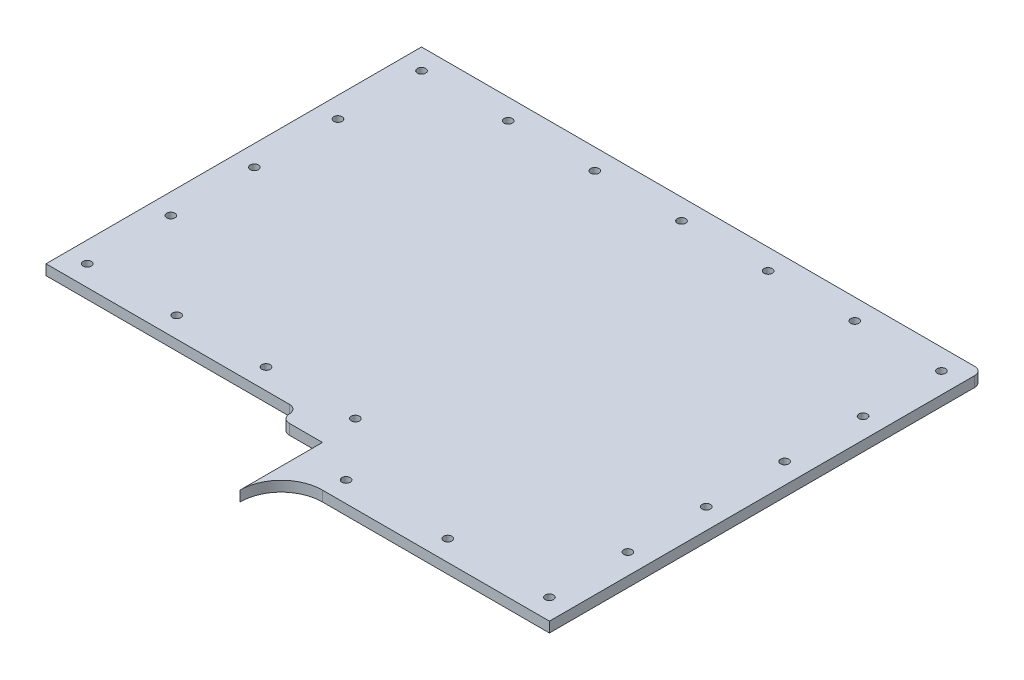
ISO-10303-21;
HEADER;
FILE_DESCRIPTION(('STEP AP214'),'2;1');
FILE_NAME('part.step','',(''),(''),'','','');
FILE_SCHEMA(('AUTOMOTIVE_DESIGN { 1 0 10303 214 1 1 1 1 }'));
ENDSEC;
DATA;
#1=APPLICATION_CONTEXT('core data for automotive mechanical design processes');
#2=APPLICATION_PROTOCOL_DEFINITION('international standard','automotive_design',2000,#1);
#3=PRODUCT_CONTEXT('',#1,'mechanical');
#4=PRODUCT('Part','Part','',(#3));
#5=PRODUCT_RELATED_PRODUCT_CATEGORY('part','',(#4));
#6=PRODUCT_DEFINITION_FORMATION('','',#4);
#7=PRODUCT_DEFINITION_CONTEXT('part definition',#1,'design');
#8=PRODUCT_DEFINITION('design','',#6,#7);
#9=PRODUCT_DEFINITION_SHAPE('','',#8);
#10=(LENGTH_UNIT() NAMED_UNIT(*) SI_UNIT(.MILLI.,.METRE.));
#11=(NAMED_UNIT(*) PLANE_ANGLE_UNIT() SI_UNIT($,.RADIAN.));
#12=(NAMED_UNIT(*) SI_UNIT($,.STERADIAN.) SOLID_ANGLE_UNIT());
#13=UNCERTAINTY_MEASURE_WITH_UNIT(LENGTH_MEASURE(1.E-05),#10,'distance_accuracy_value','');
#14=(GEOMETRIC_REPRESENTATION_CONTEXT(3) GLOBAL_UNCERTAINTY_ASSIGNED_CONTEXT((#13)) GLOBAL_UNIT_ASSIGNED_CONTEXT((#10,
#11,#12)) REPRESENTATION_CONTEXT('',''));
#15=CARTESIAN_POINT('',(0.,0.,0.));
#16=DIRECTION('',(0.,0.,1.));
#17=DIRECTION('',(1.,0.,0.));
#18=AXIS2_PLACEMENT_3D('',#15,#16,#17);
#19=CARTESIAN_POINT('',(8.88999999999993,1.5875,73.025));
#20=DIRECTION('',(0.,-1.,0.));
#21=DIRECTION('',(0.,0.,-1.));
#22=AXIS2_PLACEMENT_3D('',#19,#20,#21);
#23=CYLINDRICAL_SURFACE('',#22,6.34999999999999);
#24=CARTESIAN_POINT('',(8.88999999999993,0.,73.025));
#25=DIRECTION('',(0.,-1.,0.));
#26=DIRECTION('',(0.,0.,1.));
#27=AXIS2_PLACEMENT_3D('',#24,#25,#26);
#28=CIRCLE('',#27,6.34999999999999);
#29=CARTESIAN_POINT('',(2.53999999999993,0.,73.025));
#30=VERTEX_POINT('',#29);
#31=CARTESIAN_POINT('',(8.8899999999999,0.,66.675));
#32=VERTEX_POINT('',#31);
#33=EDGE_CURVE('E157',#30,#32,#28,.T.);
#34=ORIENTED_EDGE('',*,*,#33,.T.);
#35=DIRECTION('',(0.,-1.,0.));
#36=VECTOR('',#35,1.);
#37=CARTESIAN_POINT('',(8.8899999999999,1.5875,66.675));
#38=LINE('',#37,#36);
#39=CARTESIAN_POINT('',(8.8899999999999,1.5875,66.675));
#40=VERTEX_POINT('',#39);
#41=EDGE_CURVE('E11',#40,#32,#38,.T.);
#42=ORIENTED_EDGE('',*,*,#41,.F.);
#43=CARTESIAN_POINT('',(8.88999999999993,1.5875,73.025));
#44=DIRECTION('',(0.,-1.,0.));
#45=DIRECTION('',(0.,0.,1.));
#46=AXIS2_PLACEMENT_3D('',#43,#44,#45);
#47=CIRCLE('',#46,6.34999999999999);
#48=CARTESIAN_POINT('',(2.53999999999993,1.5875,73.025));
#49=VERTEX_POINT('',#48);
#50=EDGE_CURVE('E189',#49,#40,#47,.T.);
#51=ORIENTED_EDGE('',*,*,#50,.F.);
#52=DIRECTION('',(0.,-1.,0.));
#53=VECTOR('',#52,1.);
#54=CARTESIAN_POINT('',(2.53999999999993,1.5875,73.025));
#55=LINE('',#54,#53);
#56=EDGE_CURVE('E153',#49,#30,#55,.T.);
#57=ORIENTED_EDGE('',*,*,#56,.T.);
#58=EDGE_LOOP('',(#34,#42,#51,#57));
#59=FACE_BOUND('',#58,.T.);
#60=ADVANCED_FACE('F38',(#59),#23,.F.);
#61=CARTESIAN_POINT('',(8.8899999999999,1.5875,66.675));
#62=DIRECTION('',(0.,0.,-1.));
#63=DIRECTION('',(-1.,0.,0.));
#64=AXIS2_PLACEMENT_3D('',#61,#62,#63);
#65=PLANE('',#64);
#66=DIRECTION('',(1.,0.,0.));
#67=VECTOR('',#66,1.);
#68=CARTESIAN_POINT('',(8.8899999999999,0.,66.675));
#69=LINE('',#68,#67);
#70=CARTESIAN_POINT('',(43.815,0.,66.675));
#71=VERTEX_POINT('',#70);
#72=EDGE_CURVE('E161',#32,#71,#69,.T.);
#73=ORIENTED_EDGE('',*,*,#72,.T.);
#74=DIRECTION('',(0.,-1.,0.));
#75=VECTOR('',#74,1.);
#76=CARTESIAN_POINT('',(43.815,1.5875,66.675));
#77=LINE('',#76,#75);
#78=CARTESIAN_POINT('',(43.815,1.5875,66.675));
#79=VERTEX_POINT('',#78);
#80=EDGE_CURVE('E47',#79,#71,#77,.T.);
#81=ORIENTED_EDGE('',*,*,#80,.F.);
#82=DIRECTION('',(1.,0.,0.));
#83=VECTOR('',#82,1.);
#84=CARTESIAN_POINT('',(8.8899999999999,1.5875,66.675));
#85=LINE('',#84,#83);
#86=EDGE_CURVE('E107',#40,#79,#85,.T.);
#87=ORIENTED_EDGE('',*,*,#86,.F.);
#88=ORIENTED_EDGE('',*,*,#41,.T.);
#89=EDGE_LOOP('',(#73,#81,#87,#88));
#90=FACE_BOUND('',#89,.T.);
#91=ADVANCED_FACE('F277',(#90),#65,.F.);
#92=CARTESIAN_POINT('',(43.815,1.5875,66.675));
#93=DIRECTION('',(-1.,0.,0.));
#94=DIRECTION('',(0.,0.,1.));
#95=AXIS2_PLACEMENT_3D('',#92,#93,#94);
#96=PLANE('',#95);
#97=DIRECTION('',(0.,0.,-1.));
#98=VECTOR('',#97,1.);
#99=CARTESIAN_POINT('',(43.815,0.,66.675));
#100=LINE('',#99,#98);
#101=CARTESIAN_POINT('',(43.815,0.,1.26999999999999));
#102=VERTEX_POINT('',#101);
#103=EDGE_CURVE('E165',#71,#102,#100,.T.);
#104=ORIENTED_EDGE('',*,*,#103,.T.);
#105=DIRECTION('',(0.,-1.,0.));
#106=VECTOR('',#105,1.);
#107=CARTESIAN_POINT('',(43.815,1.5875,1.26999999999999));
#108=LINE('',#107,#106);
#109=CARTESIAN_POINT('',(43.815,1.5875,1.26999999999999));
#110=VERTEX_POINT('',#109);
#111=EDGE_CURVE('E212',#110,#102,#108,.T.);
#112=ORIENTED_EDGE('',*,*,#111,.F.);
#113=DIRECTION('',(0.,0.,-1.));
#114=VECTOR('',#113,1.);
#115=CARTESIAN_POINT('',(43.815,1.5875,66.675));
#116=LINE('',#115,#114);
#117=EDGE_CURVE('E222',#79,#110,#116,.T.);
#118=ORIENTED_EDGE('',*,*,#117,.F.);
#119=ORIENTED_EDGE('',*,*,#80,.T.);
#120=EDGE_LOOP('',(#104,#112,#118,#119));
#121=FACE_BOUND('',#120,.T.);
#122=ADVANCED_FACE('F220',(#121),#96,.F.);
#123=CARTESIAN_POINT('',(42.5796667647193,1.5875,1.23533323528069));
#124=DIRECTION('',(0.,-1.,0.));
#125=DIRECTION('',(0.,0.,-1.));
#126=AXIS2_PLACEMENT_3D('',#123,#124,#125);
#127=CYLINDRICAL_SURFACE('',#126,1.23581956076328);
#128=CARTESIAN_POINT('',(42.5796667647193,0.,1.23533323528069));
#129=DIRECTION('',(0.,1.,0.));
#130=DIRECTION('',(0.,0.,1.));
#131=AXIS2_PLACEMENT_3D('',#128,#129,#130);
#132=CIRCLE('',#131,1.23581956076328);
#133=CARTESIAN_POINT('',(42.545,0.,0.));
#134=VERTEX_POINT('',#133);
#135=EDGE_CURVE('E168',#102,#134,#132,.T.);
#136=ORIENTED_EDGE('',*,*,#135,.T.);
#137=DIRECTION('',(0.,-1.,0.));
#138=VECTOR('',#137,1.);
#139=CARTESIAN_POINT('',(42.545,1.5875,0.));
#140=LINE('',#139,#138);
#141=CARTESIAN_POINT('',(42.545,1.5875,0.));
#142=VERTEX_POINT('',#141);
#143=EDGE_CURVE('E208',#142,#134,#140,.T.);
#144=ORIENTED_EDGE('',*,*,#143,.F.);
#145=CARTESIAN_POINT('',(42.5796667647193,1.5875,1.23533323528069));
#146=DIRECTION('',(0.,1.,0.));
#147=DIRECTION('',(0.,0.,1.));
#148=AXIS2_PLACEMENT_3D('',#145,#146,#147);
#149=CIRCLE('',#148,1.23581956076328);
#150=EDGE_CURVE('E241',#110,#142,#149,.T.);
#151=ORIENTED_EDGE('',*,*,#150,.F.);
#152=ORIENTED_EDGE('',*,*,#111,.T.);
#153=EDGE_LOOP('',(#136,#144,#151,#152));
#154=FACE_BOUND('',#153,.T.);
#155=ADVANCED_FACE('F231',(#154),#127,.T.);
#156=CARTESIAN_POINT('',(42.545,1.5875,0.));
#157=DIRECTION('',(0.,0.,1.));
#158=DIRECTION('',(1.,0.,0.));
#159=AXIS2_PLACEMENT_3D('',#156,#157,#158);
#160=PLANE('',#159);
#161=DIRECTION('',(-1.,0.,0.));
#162=VECTOR('',#161,1.);
#163=CARTESIAN_POINT('',(42.545,0.,0.));
#164=LINE('',#163,#162);
#165=CARTESIAN_POINT('',(-42.545,0.,0.));
#166=VERTEX_POINT('',#165);
#167=EDGE_CURVE('E171',#134,#166,#164,.T.);
#168=ORIENTED_EDGE('',*,*,#167,.T.);
#169=DIRECTION('',(0.,-1.,0.));
#170=VECTOR('',#169,1.);
#171=CARTESIAN_POINT('',(-42.545,1.5875,0.));
#172=LINE('',#171,#170);
#173=CARTESIAN_POINT('',(-42.545,1.5875,0.));
#174=VERTEX_POINT('',#173);
#175=EDGE_CURVE('E204',#174,#166,#172,.T.);
#176=ORIENTED_EDGE('',*,*,#175,.F.);
#177=DIRECTION('',(-1.,0.,0.));
#178=VECTOR('',#177,1.);
#179=CARTESIAN_POINT('',(42.545,1.5875,0.));
#180=LINE('',#179,#178);
#181=EDGE_CURVE('E237',#142,#174,#180,.T.);
#182=ORIENTED_EDGE('',*,*,#181,.F.);
#183=ORIENTED_EDGE('',*,*,#143,.T.);
#184=EDGE_LOOP('',(#168,#176,#182,#183));
#185=FACE_BOUND('',#184,.T.);
#186=ADVANCED_FACE('F235',(#185),#160,.F.);
#187=CARTESIAN_POINT('',(-42.545,1.5875,0.));
#188=DIRECTION('',(1.,0.,0.));
#189=DIRECTION('',(0.,0.,-1.));
#190=AXIS2_PLACEMENT_3D('',#187,#188,#189);
#191=PLANE('',#190);
#192=DIRECTION('',(0.,0.,1.));
#193=VECTOR('',#192,1.);
#194=CARTESIAN_POINT('',(-42.545,0.,0.));
#195=LINE('',#194,#193);
#196=CARTESIAN_POINT('',(-42.5450000000002,0.,57.785));
#197=VERTEX_POINT('',#196);
#198=EDGE_CURVE('E174',#166,#197,#195,.T.);
#199=ORIENTED_EDGE('',*,*,#198,.T.);
#200=DIRECTION('',(0.,-1.,0.));
#201=VECTOR('',#200,1.);
#202=CARTESIAN_POINT('',(-42.5450000000002,1.5875,57.785));
#203=LINE('',#202,#201);
#204=CARTESIAN_POINT('',(-42.5450000000002,1.5875,57.785));
#205=VERTEX_POINT('',#204);
#206=EDGE_CURVE('E200',#205,#197,#203,.T.);
#207=ORIENTED_EDGE('',*,*,#206,.F.);
#208=DIRECTION('',(0.,0.,1.));
#209=VECTOR('',#208,1.);
#210=CARTESIAN_POINT('',(-42.545,1.5875,0.));
#211=LINE('',#210,#209);
#212=EDGE_CURVE('E240',#174,#205,#211,.T.);
#213=ORIENTED_EDGE('',*,*,#212,.F.);
#214=ORIENTED_EDGE('',*,*,#175,.T.);
#215=EDGE_LOOP('',(#199,#207,#213,#214));
#216=FACE_BOUND('',#215,.T.);
#217=ADVANCED_FACE('F290',(#216),#191,.F.);
#218=CARTESIAN_POINT('',(-42.5450000000002,1.5875,57.785));
#219=DIRECTION('',(0.,0.,-1.));
#220=DIRECTION('',(-1.,0.,0.));
#221=AXIS2_PLACEMENT_3D('',#218,#219,#220);
#222=PLANE('',#221);
#223=DIRECTION('',(1.,0.,0.));
#224=VECTOR('',#223,1.);
#225=CARTESIAN_POINT('',(-42.5450000000002,0.,57.785));
#226=LINE('',#225,#224);
#227=CARTESIAN_POINT('',(-5.08000000000022,0.,57.785));
#228=VERTEX_POINT('',#227);
#229=EDGE_CURVE('E177',#197,#228,#226,.T.);
#230=ORIENTED_EDGE('',*,*,#229,.T.);
#231=DIRECTION('',(0.,-1.,0.));
#232=VECTOR('',#231,1.);
#233=CARTESIAN_POINT('',(-5.08000000000022,1.5875,57.785));
#234=LINE('',#233,#232);
#235=CARTESIAN_POINT('',(-5.08000000000022,1.5875,57.785));
#236=VERTEX_POINT('',#235);
#237=EDGE_CURVE('E196',#236,#228,#234,.T.);
#238=ORIENTED_EDGE('',*,*,#237,.F.);
#239=DIRECTION('',(1.,0.,0.));
#240=VECTOR('',#239,1.);
#241=CARTESIAN_POINT('',(-42.5450000000002,1.5875,57.785));
#242=LINE('',#241,#240);
#243=EDGE_CURVE('E245',#205,#236,#242,.T.);
#244=ORIENTED_EDGE('',*,*,#243,.F.);
#245=ORIENTED_EDGE('',*,*,#206,.T.);
#246=EDGE_LOOP('',(#230,#238,#244,#245));
#247=FACE_BOUND('',#246,.T.);
#248=ADVANCED_FACE('F256',(#247),#222,.F.);
#249=CARTESIAN_POINT('',(-5.08000000000022,1.5875,59.055));
#250=DIRECTION('',(0.,-1.,0.));
#251=DIRECTION('',(0.,0.,-1.));
#252=AXIS2_PLACEMENT_3D('',#249,#250,#251);
#253=CYLINDRICAL_SURFACE('',#252,1.26999999999999);
#254=CARTESIAN_POINT('',(-5.08000000000022,0.,59.055));
#255=DIRECTION('',(0.,-1.,0.));
#256=DIRECTION('',(0.,0.,-1.));
#257=AXIS2_PLACEMENT_3D('',#254,#255,#256);
#258=CIRCLE('',#257,1.26999999999999);
#259=CARTESIAN_POINT('',(-3.81000000000023,0.,59.0550000000001));
#260=VERTEX_POINT('',#259);
#261=EDGE_CURVE('E180',#228,#260,#258,.T.);
#262=ORIENTED_EDGE('',*,*,#261,.T.);
#263=DIRECTION('',(0.,-1.,0.));
#264=VECTOR('',#263,1.);
#265=CARTESIAN_POINT('',(-3.81000000000023,1.5875,59.0550000000001));
#266=LINE('',#265,#264);
#267=CARTESIAN_POINT('',(-3.81000000000023,1.5875,59.0550000000001));
#268=VERTEX_POINT('',#267);
#269=EDGE_CURVE('E146',#268,#260,#266,.T.);
#270=ORIENTED_EDGE('',*,*,#269,.F.);
#271=CARTESIAN_POINT('',(-5.08000000000022,1.5875,59.055));
#272=DIRECTION('',(0.,-1.,0.));
#273=DIRECTION('',(0.,0.,-1.));
#274=AXIS2_PLACEMENT_3D('',#271,#272,#273);
#275=CIRCLE('',#274,1.26999999999999);
#276=EDGE_CURVE('E135',#236,#268,#275,.T.);
#277=ORIENTED_EDGE('',*,*,#276,.F.);
#278=ORIENTED_EDGE('',*,*,#237,.T.);
#279=EDGE_LOOP('',(#262,#270,#277,#278));
#280=FACE_BOUND('',#279,.T.);
#281=ADVANCED_FACE('F260',(#280),#253,.F.);
#282=CARTESIAN_POINT('',(-2.54000000000024,1.5875,59.0550000000001));
#283=DIRECTION('',(0.,-1.,0.));
#284=DIRECTION('',(0.,0.,-1.));
#285=AXIS2_PLACEMENT_3D('',#282,#283,#284);
#286=CYLINDRICAL_SURFACE('',#285,1.27);
#287=CARTESIAN_POINT('',(-2.54000000000024,0.,59.0550000000001));
#288=DIRECTION('',(0.,1.,0.));
#289=DIRECTION('',(0.,0.,1.));
#290=AXIS2_PLACEMENT_3D('',#287,#288,#289);
#291=CIRCLE('',#290,1.27);
#292=CARTESIAN_POINT('',(-2.54000000000024,0.,60.3250000000001));
#293=VERTEX_POINT('',#292);
#294=EDGE_CURVE('E144',#260,#293,#291,.T.);
#295=ORIENTED_EDGE('',*,*,#294,.T.);
#296=DIRECTION('',(0.,-1.,0.));
#297=VECTOR('',#296,1.);
#298=CARTESIAN_POINT('',(-2.54000000000024,1.5875,60.3250000000001));
#299=LINE('',#298,#297);
#300=CARTESIAN_POINT('',(-2.54000000000024,1.5875,60.3250000000001));
#301=VERTEX_POINT('',#300);
#302=EDGE_CURVE('E141',#301,#293,#299,.T.);
#303=ORIENTED_EDGE('',*,*,#302,.F.);
#304=CARTESIAN_POINT('',(-2.54000000000024,1.5875,59.0550000000001));
#305=DIRECTION('',(0.,1.,0.));
#306=DIRECTION('',(0.,0.,1.));
#307=AXIS2_PLACEMENT_3D('',#304,#305,#306);
#308=CIRCLE('',#307,1.27);
#309=EDGE_CURVE('E129',#268,#301,#308,.T.);
#310=ORIENTED_EDGE('',*,*,#309,.F.);
#311=ORIENTED_EDGE('',*,*,#269,.T.);
#312=EDGE_LOOP('',(#295,#303,#310,#311));
#313=FACE_BOUND('',#312,.T.);
#314=ADVANCED_FACE('F142',(#313),#286,.T.);
#315=CARTESIAN_POINT('',(-2.54000000000022,1.5875,60.3250000000001));
#316=DIRECTION('',(0.,0.,-1.));
#317=DIRECTION('',(-1.,0.,0.));
#318=AXIS2_PLACEMENT_3D('',#315,#316,#317);
#319=PLANE('',#318);
#320=DIRECTION('',(1.,0.,0.));
#321=VECTOR('',#320,1.);
#322=CARTESIAN_POINT('',(-2.54000000000022,0.,60.3250000000001));
#323=LINE('',#322,#321);
#324=CARTESIAN_POINT('',(2.53999999999993,0.,60.325));
#325=VERTEX_POINT('',#324);
#326=EDGE_CURVE('E93',#293,#325,#323,.T.);
#327=ORIENTED_EDGE('',*,*,#326,.T.);
#328=DIRECTION('',(0.,-1.,0.));
#329=VECTOR('',#328,1.);
#330=CARTESIAN_POINT('',(2.53999999999993,1.5875,60.325));
#331=LINE('',#330,#329);
#332=CARTESIAN_POINT('',(2.53999999999993,1.5875,60.325));
#333=VERTEX_POINT('',#332);
#334=EDGE_CURVE('E147',#333,#325,#331,.T.);
#335=ORIENTED_EDGE('',*,*,#334,.F.);
#336=DIRECTION('',(1.,0.,0.));
#337=VECTOR('',#336,1.);
#338=CARTESIAN_POINT('',(-2.54000000000022,1.5875,60.3250000000001));
#339=LINE('',#338,#337);
#340=EDGE_CURVE('E133',#301,#333,#339,.T.);
#341=ORIENTED_EDGE('',*,*,#340,.F.);
#342=ORIENTED_EDGE('',*,*,#302,.T.);
#343=EDGE_LOOP('',(#327,#335,#341,#342));
#344=FACE_BOUND('',#343,.T.);
#345=ADVANCED_FACE('F149',(#344),#319,.F.);
#346=CARTESIAN_POINT('',(2.53999999999993,1.5875,60.325));
#347=DIRECTION('',(1.,0.,0.));
#348=DIRECTION('',(0.,0.,-1.));
#349=AXIS2_PLACEMENT_3D('',#346,#347,#348);
#350=PLANE('',#349);
#351=DIRECTION('',(0.,0.,1.));
#352=VECTOR('',#351,1.);
#353=CARTESIAN_POINT('',(2.53999999999993,0.,60.325));
#354=LINE('',#353,#352);
#355=EDGE_CURVE('E99',#325,#30,#354,.T.);
#356=ORIENTED_EDGE('',*,*,#355,.T.);
#357=ORIENTED_EDGE('',*,*,#56,.F.);
#358=DIRECTION('',(0.,0.,1.));
#359=VECTOR('',#358,1.);
#360=CARTESIAN_POINT('',(2.53999999999993,1.5875,60.325));
#361=LINE('',#360,#359);
#362=EDGE_CURVE('E55',#333,#49,#361,.T.);
#363=ORIENTED_EDGE('',*,*,#362,.F.);
#364=ORIENTED_EDGE('',*,*,#334,.T.);
#365=EDGE_LOOP('',(#356,#357,#363,#364));
#366=FACE_BOUND('',#365,.T.);
#367=ADVANCED_FACE('F264',(#366),#350,.F.);
#368=CARTESIAN_POINT('',(8.88999999999993,1.5875,73.025));
#369=DIRECTION('',(0.,1.,0.));
#370=DIRECTION('',(0.,0.,1.));
#371=AXIS2_PLACEMENT_3D('',#368,#369,#370);
#372=PLANE('',#371);
#373=CARTESIAN_POINT('',(9.34880947261776,1.5875,63.5));
#374=DIRECTION('',(0.,1.,0.));
#375=DIRECTION('',(0.,0.,1.));
#376=AXIS2_PLACEMENT_3D('',#373,#374,#375);
#377=CIRCLE('',#376,0.635000000000001);
#378=CARTESIAN_POINT('',(9.34880947261776,1.5875,64.135));
#379=VERTEX_POINT('',#378);
#380=EDGE_CURVE('E162',#379,#379,#377,.T.);
#381=ORIENTED_EDGE('',*,*,#380,.F.);
#382=EDGE_LOOP('',(#381));
#383=FACE_BOUND('',#382,.T.);
#384=CARTESIAN_POINT('',(24.9944047363089,1.5875,63.4999999999999));
#385=DIRECTION('',(0.,1.,0.));
#386=DIRECTION('',(0.,0.,1.));
#387=AXIS2_PLACEMENT_3D('',#384,#385,#386);
#388=CIRCLE('',#387,0.634999999999999);
#389=CARTESIAN_POINT('',(24.9944047363089,1.5875,64.1349999999999));
#390=VERTEX_POINT('',#389);
#391=EDGE_CURVE('E667',#390,#390,#388,.T.);
#392=ORIENTED_EDGE('',*,*,#391,.F.);
#393=EDGE_LOOP('',(#392));
#394=FACE_BOUND('',#393,.T.);
#395=CARTESIAN_POINT('',(40.64,1.5875,63.4999999999999));
#396=DIRECTION('',(0.,1.,0.));
#397=DIRECTION('',(0.,0.,1.));
#398=AXIS2_PLACEMENT_3D('',#395,#396,#397);
#399=CIRCLE('',#398,0.634999999999996);
#400=CARTESIAN_POINT('',(40.64,1.5875,64.1349999999999));
#401=VERTEX_POINT('',#400);
#402=EDGE_CURVE('E663',#401,#401,#399,.T.);
#403=ORIENTED_EDGE('',*,*,#402,.F.);
#404=EDGE_LOOP('',(#403));
#405=FACE_BOUND('',#404,.T.);
#406=CARTESIAN_POINT('',(40.6399999999999,1.5875,51.4349999999999));
#407=DIRECTION('',(0.,1.,0.));
#408=DIRECTION('',(0.,0.,1.));
#409=AXIS2_PLACEMENT_3D('',#406,#407,#408);
#410=CIRCLE('',#409,0.634999999999996);
#411=CARTESIAN_POINT('',(40.6399999999999,1.5875,52.0699999999999));
#412=VERTEX_POINT('',#411);
#413=EDGE_CURVE('E659',#412,#412,#410,.T.);
#414=ORIENTED_EDGE('',*,*,#413,.F.);
#415=EDGE_LOOP('',(#414));
#416=FACE_BOUND('',#415,.T.);
#417=CARTESIAN_POINT('',(-39.3699999999999,1.5875,41.75125));
#418=DIRECTION('',(0.,1.,0.));
#419=DIRECTION('',(0.,0.,1.));
#420=AXIS2_PLACEMENT_3D('',#417,#418,#419);
#421=CIRCLE('',#420,0.635000000000003);
#422=CARTESIAN_POINT('',(-39.3699999999999,1.5875,42.38625));
#423=VERTEX_POINT('',#422);
#424=EDGE_CURVE('E655',#423,#423,#421,.T.);
#425=ORIENTED_EDGE('',*,*,#424,.F.);
#426=EDGE_LOOP('',(#425));
#427=FACE_BOUND('',#426,.T.);
#428=CARTESIAN_POINT('',(40.6399999999998,1.5875,15.24));
#429=DIRECTION('',(0.,1.,0.));
#430=DIRECTION('',(0.,0.,1.));
#431=AXIS2_PLACEMENT_3D('',#428,#429,#430);
#432=CIRCLE('',#431,0.634999999999995);
#433=CARTESIAN_POINT('',(40.6399999999998,1.5875,15.875));
#434=VERTEX_POINT('',#433);
#435=EDGE_CURVE('E651',#434,#434,#432,.T.);
#436=ORIENTED_EDGE('',*,*,#435,.F.);
#437=EDGE_LOOP('',(#436));
#438=FACE_BOUND('',#437,.T.);
#439=CARTESIAN_POINT('',(40.6399999999999,1.5875,27.305));
#440=DIRECTION('',(0.,1.,0.));
#441=DIRECTION('',(0.,0.,1.));
#442=AXIS2_PLACEMENT_3D('',#439,#440,#441);
#443=CIRCLE('',#442,0.634999999999995);
#444=CARTESIAN_POINT('',(40.6399999999999,1.5875,27.94));
#445=VERTEX_POINT('',#444);
#446=EDGE_CURVE('E647',#445,#445,#443,.T.);
#447=ORIENTED_EDGE('',*,*,#446,.F.);
#448=EDGE_LOOP('',(#447));
#449=FACE_BOUND('',#448,.T.);
#450=CARTESIAN_POINT('',(40.6399999999999,1.5875,39.3699999999999));
#451=DIRECTION('',(0.,1.,0.));
#452=DIRECTION('',(0.,0.,1.));
#453=AXIS2_PLACEMENT_3D('',#450,#451,#452);
#454=CIRCLE('',#453,0.634999999999996);
#455=CARTESIAN_POINT('',(40.6399999999999,1.5875,40.0049999999999));
#456=VERTEX_POINT('',#455);
#457=EDGE_CURVE('E643',#456,#456,#454,.T.);
#458=ORIENTED_EDGE('',*,*,#457,.F.);
#459=EDGE_LOOP('',(#458));
#460=FACE_BOUND('',#459,.T.);
#461=CARTESIAN_POINT('',(-26.0350000000001,1.5875,3.1749999999999));
#462=DIRECTION('',(0.,1.,0.));
#463=DIRECTION('',(0.,0.,1.));
#464=AXIS2_PLACEMENT_3D('',#461,#462,#463);
#465=CIRCLE('',#464,0.634999999999999);
#466=CARTESIAN_POINT('',(-26.0350000000001,1.5875,3.8099999999999));
#467=VERTEX_POINT('',#466);
#468=EDGE_CURVE('E639',#467,#467,#465,.T.);
#469=ORIENTED_EDGE('',*,*,#468,.F.);
#470=EDGE_LOOP('',(#469));
#471=FACE_BOUND('',#470,.T.);
#472=CARTESIAN_POINT('',(-12.7000000000001,1.5875,3.17499999999981));
#473=DIRECTION('',(0.,1.,0.));
#474=DIRECTION('',(0.,0.,1.));
#475=AXIS2_PLACEMENT_3D('',#472,#473,#474);
#476=CIRCLE('',#475,0.635000000000001);
#477=CARTESIAN_POINT('',(-12.7000000000001,1.5875,3.80999999999981));
#478=VERTEX_POINT('',#477);
#479=EDGE_CURVE('E635',#478,#478,#476,.T.);
#480=ORIENTED_EDGE('',*,*,#479,.F.);
#481=EDGE_LOOP('',(#480));
#482=FACE_BOUND('',#481,.T.);
#483=CARTESIAN_POINT('',(0.634999999999789,1.5875,3.17499999999972));
#484=DIRECTION('',(0.,1.,0.));
#485=DIRECTION('',(0.,0.,1.));
#486=AXIS2_PLACEMENT_3D('',#483,#484,#485);
#487=CIRCLE('',#486,0.635);
#488=CARTESIAN_POINT('',(0.634999999999789,1.5875,3.80999999999972));
#489=VERTEX_POINT('',#488);
#490=EDGE_CURVE('E631',#489,#489,#487,.T.);
#491=ORIENTED_EDGE('',*,*,#490,.F.);
#492=EDGE_LOOP('',(#491));
#493=FACE_BOUND('',#492,.T.);
#494=CARTESIAN_POINT('',(13.9699999999997,1.5875,3.17499999999962));
#495=DIRECTION('',(0.,1.,0.));
#496=DIRECTION('',(0.,0.,1.));
#497=AXIS2_PLACEMENT_3D('',#494,#495,#496);
#498=CIRCLE('',#497,0.635000000000001);
#499=CARTESIAN_POINT('',(13.9699999999997,1.5875,3.80999999999963));
#500=VERTEX_POINT('',#499);
#501=EDGE_CURVE('E627',#500,#500,#498,.T.);
#502=ORIENTED_EDGE('',*,*,#501,.F.);
#503=EDGE_LOOP('',(#502));
#504=FACE_BOUND('',#503,.T.);
#505=CARTESIAN_POINT('',(27.3049999999996,1.5875,3.17499999999953));
#506=DIRECTION('',(0.,1.,0.));
#507=DIRECTION('',(0.,0.,1.));
#508=AXIS2_PLACEMENT_3D('',#505,#506,#507);
#509=CIRCLE('',#508,0.634999999999999);
#510=CARTESIAN_POINT('',(27.3049999999996,1.5875,3.80999999999953));
#511=VERTEX_POINT('',#510);
#512=EDGE_CURVE('E623',#511,#511,#509,.T.);
#513=ORIENTED_EDGE('',*,*,#512,.F.);
#514=EDGE_LOOP('',(#513));
#515=FACE_BOUND('',#514,.T.);
#516=CARTESIAN_POINT('',(40.6399999999996,1.5875,3.17499999999963));
#517=DIRECTION('',(0.,1.,0.));
#518=DIRECTION('',(0.,0.,1.));
#519=AXIS2_PLACEMENT_3D('',#516,#517,#518);
#520=CIRCLE('',#519,0.634999999999995);
#521=CARTESIAN_POINT('',(40.6399999999996,1.5875,3.80999999999962));
#522=VERTEX_POINT('',#521);
#523=EDGE_CURVE('E619',#522,#522,#520,.T.);
#524=ORIENTED_EDGE('',*,*,#523,.F.);
#525=EDGE_LOOP('',(#524));
#526=FACE_BOUND('',#525,.T.);
#527=CARTESIAN_POINT('',(-39.37,1.5875,16.03375));
#528=DIRECTION('',(0.,1.,0.));
#529=DIRECTION('',(0.,0.,1.));
#530=AXIS2_PLACEMENT_3D('',#527,#528,#529);
#531=CIRCLE('',#530,0.634999999999995);
#532=CARTESIAN_POINT('',(-39.37,1.5875,16.66875));
#533=VERTEX_POINT('',#532);
#534=EDGE_CURVE('E615',#533,#533,#531,.T.);
#535=ORIENTED_EDGE('',*,*,#534,.F.);
#536=EDGE_LOOP('',(#535));
#537=FACE_BOUND('',#536,.T.);
#538=CARTESIAN_POINT('',(-39.3699999999999,1.5875,28.8925));
#539=DIRECTION('',(0.,1.,0.));
#540=DIRECTION('',(0.,0.,1.));
#541=AXIS2_PLACEMENT_3D('',#538,#539,#540);
#542=CIRCLE('',#541,0.635000000000003);
#543=CARTESIAN_POINT('',(-39.3699999999999,1.5875,29.5275));
#544=VERTEX_POINT('',#543);
#545=EDGE_CURVE('E611',#544,#544,#542,.T.);
#546=ORIENTED_EDGE('',*,*,#545,.F.);
#547=EDGE_LOOP('',(#546));
#548=FACE_BOUND('',#547,.T.);
#549=CARTESIAN_POINT('',(1.88921375145161,1.5875,54.6099999999999));
#550=DIRECTION('',(0.,1.,0.));
#551=DIRECTION('',(0.,0.,1.));
#552=AXIS2_PLACEMENT_3D('',#549,#550,#551);
#553=CIRCLE('',#552,0.635000000000001);
#554=CARTESIAN_POINT('',(1.88921375145161,1.5875,55.2449999999999));
#555=VERTEX_POINT('',#554);
#556=EDGE_CURVE('E607',#555,#555,#553,.T.);
#557=ORIENTED_EDGE('',*,*,#556,.F.);
#558=EDGE_LOOP('',(#557));
#559=FACE_BOUND('',#558,.T.);
#560=CARTESIAN_POINT('',(-11.8638574990322,1.5875,54.6099999999999));
#561=DIRECTION('',(0.,1.,0.));
#562=DIRECTION('',(0.,0.,1.));
#563=AXIS2_PLACEMENT_3D('',#560,#561,#562);
#564=CIRCLE('',#563,0.635000000000001);
#565=CARTESIAN_POINT('',(-11.8638574990322,1.5875,55.2449999999999));
#566=VERTEX_POINT('',#565);
#567=EDGE_CURVE('E603',#566,#566,#564,.T.);
#568=ORIENTED_EDGE('',*,*,#567,.F.);
#569=EDGE_LOOP('',(#568));
#570=FACE_BOUND('',#569,.T.);
#571=CARTESIAN_POINT('',(-25.616928749516,1.5875,54.6099999999999));
#572=DIRECTION('',(0.,1.,0.));
#573=DIRECTION('',(0.,0.,1.));
#574=AXIS2_PLACEMENT_3D('',#571,#572,#573);
#575=CIRCLE('',#574,0.634999999999999);
#576=CARTESIAN_POINT('',(-25.616928749516,1.5875,55.2449999999999));
#577=VERTEX_POINT('',#576);
#578=EDGE_CURVE('E599',#577,#577,#575,.T.);
#579=ORIENTED_EDGE('',*,*,#578,.F.);
#580=EDGE_LOOP('',(#579));
#581=FACE_BOUND('',#580,.T.);
#582=CARTESIAN_POINT('',(-39.3699999999998,1.5875,54.61));
#583=DIRECTION('',(0.,1.,0.));
#584=DIRECTION('',(0.,0.,1.));
#585=AXIS2_PLACEMENT_3D('',#582,#583,#584);
#586=CIRCLE('',#585,0.635000000000003);
#587=CARTESIAN_POINT('',(-39.3699999999998,1.5875,55.245));
#588=VERTEX_POINT('',#587);
#589=EDGE_CURVE('E595',#588,#588,#586,.T.);
#590=ORIENTED_EDGE('',*,*,#589,.F.);
#591=EDGE_LOOP('',(#590));
#592=FACE_BOUND('',#591,.T.);
#593=CARTESIAN_POINT('',(-39.37,1.5875,3.175));
#594=DIRECTION('',(0.,1.,0.));
#595=DIRECTION('',(0.,0.,1.));
#596=AXIS2_PLACEMENT_3D('',#593,#594,#595);
#597=CIRCLE('',#596,0.634999999999995);
#598=CARTESIAN_POINT('',(-39.37,1.5875,3.80999999999999));
#599=VERTEX_POINT('',#598);
#600=EDGE_CURVE('E591',#599,#599,#597,.T.);
#601=ORIENTED_EDGE('',*,*,#600,.F.);
#602=EDGE_LOOP('',(#601));
#603=FACE_BOUND('',#602,.T.);
#604=ORIENTED_EDGE('',*,*,#50,.T.);
#605=ORIENTED_EDGE('',*,*,#86,.T.);
#606=ORIENTED_EDGE('',*,*,#117,.T.);
#607=ORIENTED_EDGE('',*,*,#150,.T.);
#608=ORIENTED_EDGE('',*,*,#181,.T.);
#609=ORIENTED_EDGE('',*,*,#212,.T.);
#610=ORIENTED_EDGE('',*,*,#243,.T.);
#611=ORIENTED_EDGE('',*,*,#276,.T.);
#612=ORIENTED_EDGE('',*,*,#309,.T.);
#613=ORIENTED_EDGE('',*,*,#340,.T.);
#614=ORIENTED_EDGE('',*,*,#362,.T.);
#615=EDGE_LOOP('',(#604,#605,#606,#607,#608,#609,#610,#611,#612,#613,#614));
#616=FACE_BOUND('',#615,.T.);
#617=ADVANCED_FACE('F131',(#383,#394,#405,#416,#427,#438,#449,#460,#471,#482,#493,#504,#515,
#526,#537,#548,#559,#570,#581,#592,#603,#616),#372,.T.);
#618=CARTESIAN_POINT('',(8.88999999999993,0.,73.025));
#619=DIRECTION('',(0.,1.,0.));
#620=DIRECTION('',(0.,0.,1.));
#621=AXIS2_PLACEMENT_3D('',#618,#619,#620);
#622=PLANE('',#621);
#623=CARTESIAN_POINT('',(9.34880947261776,0.,63.5));
#624=DIRECTION('',(0.,1.,0.));
#625=DIRECTION('',(0.,0.,1.));
#626=AXIS2_PLACEMENT_3D('',#623,#624,#625);
#627=CIRCLE('',#626,0.635000000000001);
#628=CARTESIAN_POINT('',(9.34880947261776,0.,64.135));
#629=VERTEX_POINT('',#628);
#630=EDGE_CURVE('E539',#629,#629,#627,.T.);
#631=ORIENTED_EDGE('',*,*,#630,.T.);
#632=EDGE_LOOP('',(#631));
#633=FACE_BOUND('',#632,.T.);
#634=CARTESIAN_POINT('',(24.9944047363089,0.,63.4999999999999));
#635=DIRECTION('',(0.,1.,0.));
#636=DIRECTION('',(0.,0.,1.));
#637=AXIS2_PLACEMENT_3D('',#634,#635,#636);
#638=CIRCLE('',#637,0.634999999999999);
#639=CARTESIAN_POINT('',(24.9944047363089,0.,64.1349999999999));
#640=VERTEX_POINT('',#639);
#641=EDGE_CURVE('E541',#640,#640,#638,.T.);
#642=ORIENTED_EDGE('',*,*,#641,.T.);
#643=EDGE_LOOP('',(#642));
#644=FACE_BOUND('',#643,.T.);
#645=CARTESIAN_POINT('',(40.64,0.,63.4999999999999));
#646=DIRECTION('',(0.,1.,0.));
#647=DIRECTION('',(0.,0.,1.));
#648=AXIS2_PLACEMENT_3D('',#645,#646,#647);
#649=CIRCLE('',#648,0.634999999999996);
#650=CARTESIAN_POINT('',(40.64,0.,64.1349999999999));
#651=VERTEX_POINT('',#650);
#652=EDGE_CURVE('E547',#651,#651,#649,.T.);
#653=ORIENTED_EDGE('',*,*,#652,.T.);
#654=EDGE_LOOP('',(#653));
#655=FACE_BOUND('',#654,.T.);
#656=CARTESIAN_POINT('',(40.6399999999999,0.,51.4349999999999));
#657=DIRECTION('',(0.,1.,0.));
#658=DIRECTION('',(0.,0.,1.));
#659=AXIS2_PLACEMENT_3D('',#656,#657,#658);
#660=CIRCLE('',#659,0.634999999999996);
#661=CARTESIAN_POINT('',(40.6399999999999,0.,52.0699999999999));
#662=VERTEX_POINT('',#661);
#663=EDGE_CURVE('E692',#662,#662,#660,.T.);
#664=ORIENTED_EDGE('',*,*,#663,.T.);
#665=EDGE_LOOP('',(#664));
#666=FACE_BOUND('',#665,.T.);
#667=CARTESIAN_POINT('',(-39.3699999999999,0.,41.75125));
#668=DIRECTION('',(0.,1.,0.));
#669=DIRECTION('',(0.,0.,1.));
#670=AXIS2_PLACEMENT_3D('',#667,#668,#669);
#671=CIRCLE('',#670,0.635000000000003);
#672=CARTESIAN_POINT('',(-39.3699999999999,0.,42.38625));
#673=VERTEX_POINT('',#672);
#674=EDGE_CURVE('E571',#673,#673,#671,.T.);
#675=ORIENTED_EDGE('',*,*,#674,.T.);
#676=EDGE_LOOP('',(#675));
#677=FACE_BOUND('',#676,.T.);
#678=CARTESIAN_POINT('',(40.6399999999998,0.,15.24));
#679=DIRECTION('',(0.,1.,0.));
#680=DIRECTION('',(0.,0.,1.));
#681=AXIS2_PLACEMENT_3D('',#678,#679,#680);
#682=CIRCLE('',#681,0.634999999999995);
#683=CARTESIAN_POINT('',(40.6399999999998,0.,15.875));
#684=VERTEX_POINT('',#683);
#685=EDGE_CURVE('E680',#684,#684,#682,.T.);
#686=ORIENTED_EDGE('',*,*,#685,.T.);
#687=EDGE_LOOP('',(#686));
#688=FACE_BOUND('',#687,.T.);
#689=CARTESIAN_POINT('',(40.6399999999999,0.,27.305));
#690=DIRECTION('',(0.,1.,0.));
#691=DIRECTION('',(0.,0.,1.));
#692=AXIS2_PLACEMENT_3D('',#689,#690,#691);
#693=CIRCLE('',#692,0.634999999999995);
#694=CARTESIAN_POINT('',(40.6399999999999,0.,27.94));
#695=VERTEX_POINT('',#694);
#696=EDGE_CURVE('E684',#695,#695,#693,.T.);
#697=ORIENTED_EDGE('',*,*,#696,.T.);
#698=EDGE_LOOP('',(#697));
#699=FACE_BOUND('',#698,.T.);
#700=CARTESIAN_POINT('',(40.6399999999999,0.,39.3699999999999));
#701=DIRECTION('',(0.,1.,0.));
#702=DIRECTION('',(0.,0.,1.));
#703=AXIS2_PLACEMENT_3D('',#700,#701,#702);
#704=CIRCLE('',#703,0.634999999999996);
#705=CARTESIAN_POINT('',(40.6399999999999,0.,40.0049999999999));
#706=VERTEX_POINT('',#705);
#707=EDGE_CURVE('E688',#706,#706,#704,.T.);
#708=ORIENTED_EDGE('',*,*,#707,.T.);
#709=EDGE_LOOP('',(#708));
#710=FACE_BOUND('',#709,.T.);
#711=CARTESIAN_POINT('',(-26.0350000000001,0.,3.1749999999999));
#712=DIRECTION('',(0.,1.,0.));
#713=DIRECTION('',(0.,0.,1.));
#714=AXIS2_PLACEMENT_3D('',#711,#712,#713);
#715=CIRCLE('',#714,0.634999999999999);
#716=CARTESIAN_POINT('',(-26.0350000000001,0.,3.8099999999999));
#717=VERTEX_POINT('',#716);
#718=EDGE_CURVE('E572',#717,#717,#715,.T.);
#719=ORIENTED_EDGE('',*,*,#718,.T.);
#720=EDGE_LOOP('',(#719));
#721=FACE_BOUND('',#720,.T.);
#722=CARTESIAN_POINT('',(-12.7000000000001,0.,3.17499999999981));
#723=DIRECTION('',(0.,1.,0.));
#724=DIRECTION('',(0.,0.,1.));
#725=AXIS2_PLACEMENT_3D('',#722,#723,#724);
#726=CIRCLE('',#725,0.635000000000001);
#727=CARTESIAN_POINT('',(-12.7000000000001,0.,3.80999999999981));
#728=VERTEX_POINT('',#727);
#729=EDGE_CURVE('E577',#728,#728,#726,.T.);
#730=ORIENTED_EDGE('',*,*,#729,.T.);
#731=EDGE_LOOP('',(#730));
#732=FACE_BOUND('',#731,.T.);
#733=CARTESIAN_POINT('',(0.634999999999789,0.,3.17499999999972));
#734=DIRECTION('',(0.,1.,0.));
#735=DIRECTION('',(0.,0.,1.));
#736=AXIS2_PLACEMENT_3D('',#733,#734,#735);
#737=CIRCLE('',#736,0.635);
#738=CARTESIAN_POINT('',(0.634999999999789,0.,3.80999999999972));
#739=VERTEX_POINT('',#738);
#740=EDGE_CURVE('E581',#739,#739,#737,.T.);
#741=ORIENTED_EDGE('',*,*,#740,.T.);
#742=EDGE_LOOP('',(#741));
#743=FACE_BOUND('',#742,.T.);
#744=CARTESIAN_POINT('',(13.9699999999997,0.,3.17499999999962));
#745=DIRECTION('',(0.,1.,0.));
#746=DIRECTION('',(0.,0.,1.));
#747=AXIS2_PLACEMENT_3D('',#744,#745,#746);
#748=CIRCLE('',#747,0.635000000000001);
#749=CARTESIAN_POINT('',(13.9699999999997,0.,3.80999999999963));
#750=VERTEX_POINT('',#749);
#751=EDGE_CURVE('E558',#750,#750,#748,.T.);
#752=ORIENTED_EDGE('',*,*,#751,.T.);
#753=EDGE_LOOP('',(#752));
#754=FACE_BOUND('',#753,.T.);
#755=CARTESIAN_POINT('',(27.3049999999996,0.,3.17499999999953));
#756=DIRECTION('',(0.,1.,0.));
#757=DIRECTION('',(0.,0.,1.));
#758=AXIS2_PLACEMENT_3D('',#755,#756,#757);
#759=CIRCLE('',#758,0.634999999999999);
#760=CARTESIAN_POINT('',(27.3049999999996,0.,3.80999999999953));
#761=VERTEX_POINT('',#760);
#762=EDGE_CURVE('E554',#761,#761,#759,.T.);
#763=ORIENTED_EDGE('',*,*,#762,.T.);
#764=EDGE_LOOP('',(#763));
#765=FACE_BOUND('',#764,.T.);
#766=CARTESIAN_POINT('',(40.6399999999996,0.,3.17499999999963));
#767=DIRECTION('',(0.,1.,0.));
#768=DIRECTION('',(0.,0.,1.));
#769=AXIS2_PLACEMENT_3D('',#766,#767,#768);
#770=CIRCLE('',#769,0.634999999999995);
#771=CARTESIAN_POINT('',(40.6399999999996,0.,3.80999999999962));
#772=VERTEX_POINT('',#771);
#773=EDGE_CURVE('E559',#772,#772,#770,.T.);
#774=ORIENTED_EDGE('',*,*,#773,.T.);
#775=EDGE_LOOP('',(#774));
#776=FACE_BOUND('',#775,.T.);
#777=CARTESIAN_POINT('',(-39.37,0.,16.03375));
#778=DIRECTION('',(0.,1.,0.));
#779=DIRECTION('',(0.,0.,1.));
#780=AXIS2_PLACEMENT_3D('',#777,#778,#779);
#781=CIRCLE('',#780,0.634999999999995);
#782=CARTESIAN_POINT('',(-39.37,0.,16.66875));
#783=VERTEX_POINT('',#782);
#784=EDGE_CURVE('E563',#783,#783,#781,.T.);
#785=ORIENTED_EDGE('',*,*,#784,.T.);
#786=EDGE_LOOP('',(#785));
#787=FACE_BOUND('',#786,.T.);
#788=CARTESIAN_POINT('',(-39.3699999999999,0.,28.8925));
#789=DIRECTION('',(0.,1.,0.));
#790=DIRECTION('',(0.,0.,1.));
#791=AXIS2_PLACEMENT_3D('',#788,#789,#790);
#792=CIRCLE('',#791,0.635000000000003);
#793=CARTESIAN_POINT('',(-39.3699999999999,0.,29.5275));
#794=VERTEX_POINT('',#793);
#795=EDGE_CURVE('E567',#794,#794,#792,.T.);
#796=ORIENTED_EDGE('',*,*,#795,.T.);
#797=EDGE_LOOP('',(#796));
#798=FACE_BOUND('',#797,.T.);
#799=CARTESIAN_POINT('',(1.88921375145161,0.,54.6099999999999));
#800=DIRECTION('',(0.,1.,0.));
#801=DIRECTION('',(0.,0.,1.));
#802=AXIS2_PLACEMENT_3D('',#799,#800,#801);
#803=CIRCLE('',#802,0.635000000000001);
#804=CARTESIAN_POINT('',(1.88921375145161,0.,55.2449999999999));
#805=VERTEX_POINT('',#804);
#806=EDGE_CURVE('E542',#805,#805,#803,.T.);
#807=ORIENTED_EDGE('',*,*,#806,.T.);
#808=EDGE_LOOP('',(#807));
#809=FACE_BOUND('',#808,.T.);
#810=CARTESIAN_POINT('',(-11.8638574990322,0.,54.6099999999999));
#811=DIRECTION('',(0.,1.,0.));
#812=DIRECTION('',(0.,0.,1.));
#813=AXIS2_PLACEMENT_3D('',#810,#811,#812);
#814=CIRCLE('',#813,0.635000000000001);
#815=CARTESIAN_POINT('',(-11.8638574990322,0.,55.2449999999999));
#816=VERTEX_POINT('',#815);
#817=EDGE_CURVE('E550',#816,#816,#814,.T.);
#818=ORIENTED_EDGE('',*,*,#817,.T.);
#819=EDGE_LOOP('',(#818));
#820=FACE_BOUND('',#819,.T.);
#821=CARTESIAN_POINT('',(-25.616928749516,0.,54.6099999999999));
#822=DIRECTION('',(0.,1.,0.));
#823=DIRECTION('',(0.,0.,1.));
#824=AXIS2_PLACEMENT_3D('',#821,#822,#823);
#825=CIRCLE('',#824,0.634999999999999);
#826=CARTESIAN_POINT('',(-25.616928749516,0.,55.2449999999999));
#827=VERTEX_POINT('',#826);
#828=EDGE_CURVE('E705',#827,#827,#825,.T.);
#829=ORIENTED_EDGE('',*,*,#828,.T.);
#830=EDGE_LOOP('',(#829));
#831=FACE_BOUND('',#830,.T.);
#832=CARTESIAN_POINT('',(-39.3699999999998,0.,54.61));
#833=DIRECTION('',(0.,1.,0.));
#834=DIRECTION('',(0.,0.,1.));
#835=AXIS2_PLACEMENT_3D('',#832,#833,#834);
#836=CIRCLE('',#835,0.635000000000003);
#837=CARTESIAN_POINT('',(-39.3699999999998,0.,55.245));
#838=VERTEX_POINT('',#837);
#839=EDGE_CURVE('E701',#838,#838,#836,.T.);
#840=ORIENTED_EDGE('',*,*,#839,.T.);
#841=EDGE_LOOP('',(#840));
#842=FACE_BOUND('',#841,.T.);
#843=CARTESIAN_POINT('',(-39.37,0.,3.175));
#844=DIRECTION('',(0.,1.,0.));
#845=DIRECTION('',(0.,0.,1.));
#846=AXIS2_PLACEMENT_3D('',#843,#844,#845);
#847=CIRCLE('',#846,0.634999999999995);
#848=CARTESIAN_POINT('',(-39.37,0.,3.80999999999999));
#849=VERTEX_POINT('',#848);
#850=EDGE_CURVE('E576',#849,#849,#847,.T.);
#851=ORIENTED_EDGE('',*,*,#850,.T.);
#852=EDGE_LOOP('',(#851));
#853=FACE_BOUND('',#852,.T.);
#854=ORIENTED_EDGE('',*,*,#33,.F.);
#855=ORIENTED_EDGE('',*,*,#355,.F.);
#856=ORIENTED_EDGE('',*,*,#326,.F.);
#857=ORIENTED_EDGE('',*,*,#294,.F.);
#858=ORIENTED_EDGE('',*,*,#261,.F.);
#859=ORIENTED_EDGE('',*,*,#229,.F.);
#860=ORIENTED_EDGE('',*,*,#198,.F.);
#861=ORIENTED_EDGE('',*,*,#167,.F.);
#862=ORIENTED_EDGE('',*,*,#135,.F.);
#863=ORIENTED_EDGE('',*,*,#103,.F.);
#864=ORIENTED_EDGE('',*,*,#72,.F.);
#865=EDGE_LOOP('',(#854,#855,#856,#857,#858,#859,#860,#861,#862,#863,#864));
#866=FACE_BOUND('',#865,.T.);
#867=ADVANCED_FACE('F226',(#633,#644,#655,#666,#677,#688,#699,#710,#721,#732,#743,#754,#765,
#776,#787,#798,#809,#820,#831,#842,#853,#866),#622,.F.);
#868=CARTESIAN_POINT('',(-39.37,0.,3.175));
#869=DIRECTION('',(0.,1.,0.));
#870=DIRECTION('',(0.,0.,1.));
#871=AXIS2_PLACEMENT_3D('',#868,#869,#870);
#872=CYLINDRICAL_SURFACE('',#871,0.634999999999995);
#873=ORIENTED_EDGE('',*,*,#600,.T.);
#874=EDGE_LOOP('',(#873));
#875=FACE_BOUND('',#874,.T.);
#876=ORIENTED_EDGE('',*,*,#850,.F.);
#877=EDGE_LOOP('',(#876));
#878=FACE_BOUND('',#877,.T.);
#879=ADVANCED_FACE('F322',(#875,#878),#872,.F.);
#880=CARTESIAN_POINT('',(-39.3699999999998,0.,54.61));
#881=DIRECTION('',(0.,1.,0.));
#882=DIRECTION('',(0.,0.,1.));
#883=AXIS2_PLACEMENT_3D('',#880,#881,#882);
#884=CYLINDRICAL_SURFACE('',#883,0.635000000000003);
#885=ORIENTED_EDGE('',*,*,#589,.T.);
#886=EDGE_LOOP('',(#885));
#887=FACE_BOUND('',#886,.T.);
#888=ORIENTED_EDGE('',*,*,#839,.F.);
#889=EDGE_LOOP('',(#888));
#890=FACE_BOUND('',#889,.T.);
#891=ADVANCED_FACE('F330',(#887,#890),#884,.F.);
#892=CARTESIAN_POINT('',(-25.616928749516,0.,54.6099999999999));
#893=DIRECTION('',(0.,1.,0.));
#894=DIRECTION('',(0.,0.,1.));
#895=AXIS2_PLACEMENT_3D('',#892,#893,#894);
#896=CYLINDRICAL_SURFACE('',#895,0.634999999999999);
#897=ORIENTED_EDGE('',*,*,#578,.T.);
#898=EDGE_LOOP('',(#897));
#899=FACE_BOUND('',#898,.T.);
#900=ORIENTED_EDGE('',*,*,#828,.F.);
#901=EDGE_LOOP('',(#900));
#902=FACE_BOUND('',#901,.T.);
#903=ADVANCED_FACE('F340',(#899,#902),#896,.F.);
#904=CARTESIAN_POINT('',(-11.8638574990322,0.,54.6099999999999));
#905=DIRECTION('',(0.,1.,0.));
#906=DIRECTION('',(0.,0.,1.));
#907=AXIS2_PLACEMENT_3D('',#904,#905,#906);
#908=CYLINDRICAL_SURFACE('',#907,0.635000000000001);
#909=ORIENTED_EDGE('',*,*,#567,.T.);
#910=EDGE_LOOP('',(#909));
#911=FACE_BOUND('',#910,.T.);
#912=ORIENTED_EDGE('',*,*,#817,.F.);
#913=EDGE_LOOP('',(#912));
#914=FACE_BOUND('',#913,.T.);
#915=ADVANCED_FACE('F350',(#911,#914),#908,.F.);
#916=CARTESIAN_POINT('',(1.88921375145161,0.,54.6099999999999));
#917=DIRECTION('',(0.,1.,0.));
#918=DIRECTION('',(0.,0.,1.));
#919=AXIS2_PLACEMENT_3D('',#916,#917,#918);
#920=CYLINDRICAL_SURFACE('',#919,0.635000000000001);
#921=ORIENTED_EDGE('',*,*,#556,.T.);
#922=EDGE_LOOP('',(#921));
#923=FACE_BOUND('',#922,.T.);
#924=ORIENTED_EDGE('',*,*,#806,.F.);
#925=EDGE_LOOP('',(#924));
#926=FACE_BOUND('',#925,.T.);
#927=ADVANCED_FACE('F360',(#923,#926),#920,.F.);
#928=CARTESIAN_POINT('',(-39.3699999999999,0.,28.8925));
#929=DIRECTION('',(0.,1.,0.));
#930=DIRECTION('',(0.,0.,1.));
#931=AXIS2_PLACEMENT_3D('',#928,#929,#930);
#932=CYLINDRICAL_SURFACE('',#931,0.635000000000003);
#933=ORIENTED_EDGE('',*,*,#545,.T.);
#934=EDGE_LOOP('',(#933));
#935=FACE_BOUND('',#934,.T.);
#936=ORIENTED_EDGE('',*,*,#795,.F.);
#937=EDGE_LOOP('',(#936));
#938=FACE_BOUND('',#937,.T.);
#939=ADVANCED_FACE('F370',(#935,#938),#932,.F.);
#940=CARTESIAN_POINT('',(-39.37,0.,16.03375));
#941=DIRECTION('',(0.,1.,0.));
#942=DIRECTION('',(0.,0.,1.));
#943=AXIS2_PLACEMENT_3D('',#940,#941,#942);
#944=CYLINDRICAL_SURFACE('',#943,0.634999999999995);
#945=ORIENTED_EDGE('',*,*,#534,.T.);
#946=EDGE_LOOP('',(#945));
#947=FACE_BOUND('',#946,.T.);
#948=ORIENTED_EDGE('',*,*,#784,.F.);
#949=EDGE_LOOP('',(#948));
#950=FACE_BOUND('',#949,.T.);
#951=ADVANCED_FACE('F380',(#947,#950),#944,.F.);
#952=CARTESIAN_POINT('',(40.6399999999996,0.,3.17499999999963));
#953=DIRECTION('',(0.,1.,0.));
#954=DIRECTION('',(0.,0.,1.));
#955=AXIS2_PLACEMENT_3D('',#952,#953,#954);
#956=CYLINDRICAL_SURFACE('',#955,0.634999999999995);
#957=ORIENTED_EDGE('',*,*,#523,.T.);
#958=EDGE_LOOP('',(#957));
#959=FACE_BOUND('',#958,.T.);
#960=ORIENTED_EDGE('',*,*,#773,.F.);
#961=EDGE_LOOP('',(#960));
#962=FACE_BOUND('',#961,.T.);
#963=ADVANCED_FACE('F390',(#959,#962),#956,.F.);
#964=CARTESIAN_POINT('',(27.3049999999996,0.,3.17499999999953));
#965=DIRECTION('',(0.,1.,0.));
#966=DIRECTION('',(0.,0.,1.));
#967=AXIS2_PLACEMENT_3D('',#964,#965,#966);
#968=CYLINDRICAL_SURFACE('',#967,0.634999999999999);
#969=ORIENTED_EDGE('',*,*,#512,.T.);
#970=EDGE_LOOP('',(#969));
#971=FACE_BOUND('',#970,.T.);
#972=ORIENTED_EDGE('',*,*,#762,.F.);
#973=EDGE_LOOP('',(#972));
#974=FACE_BOUND('',#973,.T.);
#975=ADVANCED_FACE('F400',(#971,#974),#968,.F.);
#976=CARTESIAN_POINT('',(13.9699999999997,0.,3.17499999999962));
#977=DIRECTION('',(0.,1.,0.));
#978=DIRECTION('',(0.,0.,1.));
#979=AXIS2_PLACEMENT_3D('',#976,#977,#978);
#980=CYLINDRICAL_SURFACE('',#979,0.635000000000001);
#981=ORIENTED_EDGE('',*,*,#501,.T.);
#982=EDGE_LOOP('',(#981));
#983=FACE_BOUND('',#982,.T.);
#984=ORIENTED_EDGE('',*,*,#751,.F.);
#985=EDGE_LOOP('',(#984));
#986=FACE_BOUND('',#985,.T.);
#987=ADVANCED_FACE('F410',(#983,#986),#980,.F.);
#988=CARTESIAN_POINT('',(0.634999999999789,0.,3.17499999999972));
#989=DIRECTION('',(0.,1.,0.));
#990=DIRECTION('',(0.,0.,1.));
#991=AXIS2_PLACEMENT_3D('',#988,#989,#990);
#992=CYLINDRICAL_SURFACE('',#991,0.635);
#993=ORIENTED_EDGE('',*,*,#490,.T.);
#994=EDGE_LOOP('',(#993));
#995=FACE_BOUND('',#994,.T.);
#996=ORIENTED_EDGE('',*,*,#740,.F.);
#997=EDGE_LOOP('',(#996));
#998=FACE_BOUND('',#997,.T.);
#999=ADVANCED_FACE('F420',(#995,#998),#992,.F.);
#1000=CARTESIAN_POINT('',(-12.7000000000001,0.,3.17499999999981));
#1001=DIRECTION('',(0.,1.,0.));
#1002=DIRECTION('',(0.,0.,1.));
#1003=AXIS2_PLACEMENT_3D('',#1000,#1001,#1002);
#1004=CYLINDRICAL_SURFACE('',#1003,0.635000000000001);
#1005=ORIENTED_EDGE('',*,*,#479,.T.);
#1006=EDGE_LOOP('',(#1005));
#1007=FACE_BOUND('',#1006,.T.);
#1008=ORIENTED_EDGE('',*,*,#729,.F.);
#1009=EDGE_LOOP('',(#1008));
#1010=FACE_BOUND('',#1009,.T.);
#1011=ADVANCED_FACE('F430',(#1007,#1010),#1004,.F.);
#1012=CARTESIAN_POINT('',(-26.0350000000001,0.,3.1749999999999));
#1013=DIRECTION('',(0.,1.,0.));
#1014=DIRECTION('',(0.,0.,1.));
#1015=AXIS2_PLACEMENT_3D('',#1012,#1013,#1014);
#1016=CYLINDRICAL_SURFACE('',#1015,0.634999999999999);
#1017=ORIENTED_EDGE('',*,*,#468,.T.);
#1018=EDGE_LOOP('',(#1017));
#1019=FACE_BOUND('',#1018,.T.);
#1020=ORIENTED_EDGE('',*,*,#718,.F.);
#1021=EDGE_LOOP('',(#1020));
#1022=FACE_BOUND('',#1021,.T.);
#1023=ADVANCED_FACE('F440',(#1019,#1022),#1016,.F.);
#1024=CARTESIAN_POINT('',(40.6399999999999,0.,39.3699999999999));
#1025=DIRECTION('',(0.,1.,0.));
#1026=DIRECTION('',(0.,0.,1.));
#1027=AXIS2_PLACEMENT_3D('',#1024,#1025,#1026);
#1028=CYLINDRICAL_SURFACE('',#1027,0.634999999999996);
#1029=ORIENTED_EDGE('',*,*,#457,.T.);
#1030=EDGE_LOOP('',(#1029));
#1031=FACE_BOUND('',#1030,.T.);
#1032=ORIENTED_EDGE('',*,*,#707,.F.);
#1033=EDGE_LOOP('',(#1032));
#1034=FACE_BOUND('',#1033,.T.);
#1035=ADVANCED_FACE('F450',(#1031,#1034),#1028,.F.);
#1036=CARTESIAN_POINT('',(40.6399999999999,0.,27.305));
#1037=DIRECTION('',(0.,1.,0.));
#1038=DIRECTION('',(0.,0.,1.));
#1039=AXIS2_PLACEMENT_3D('',#1036,#1037,#1038);
#1040=CYLINDRICAL_SURFACE('',#1039,0.634999999999995);
#1041=ORIENTED_EDGE('',*,*,#446,.T.);
#1042=EDGE_LOOP('',(#1041));
#1043=FACE_BOUND('',#1042,.T.);
#1044=ORIENTED_EDGE('',*,*,#696,.F.);
#1045=EDGE_LOOP('',(#1044));
#1046=FACE_BOUND('',#1045,.T.);
#1047=ADVANCED_FACE('F460',(#1043,#1046),#1040,.F.);
#1048=CARTESIAN_POINT('',(40.6399999999998,0.,15.24));
#1049=DIRECTION('',(0.,1.,0.));
#1050=DIRECTION('',(0.,0.,1.));
#1051=AXIS2_PLACEMENT_3D('',#1048,#1049,#1050);
#1052=CYLINDRICAL_SURFACE('',#1051,0.634999999999995);
#1053=ORIENTED_EDGE('',*,*,#435,.T.);
#1054=EDGE_LOOP('',(#1053));
#1055=FACE_BOUND('',#1054,.T.);
#1056=ORIENTED_EDGE('',*,*,#685,.F.);
#1057=EDGE_LOOP('',(#1056));
#1058=FACE_BOUND('',#1057,.T.);
#1059=ADVANCED_FACE('F470',(#1055,#1058),#1052,.F.);
#1060=CARTESIAN_POINT('',(-39.3699999999999,0.,41.75125));
#1061=DIRECTION('',(0.,1.,0.));
#1062=DIRECTION('',(0.,0.,1.));
#1063=AXIS2_PLACEMENT_3D('',#1060,#1061,#1062);
#1064=CYLINDRICAL_SURFACE('',#1063,0.635000000000003);
#1065=ORIENTED_EDGE('',*,*,#424,.T.);
#1066=EDGE_LOOP('',(#1065));
#1067=FACE_BOUND('',#1066,.T.);
#1068=ORIENTED_EDGE('',*,*,#674,.F.);
#1069=EDGE_LOOP('',(#1068));
#1070=FACE_BOUND('',#1069,.T.);
#1071=ADVANCED_FACE('F480',(#1067,#1070),#1064,.F.);
#1072=CARTESIAN_POINT('',(40.6399999999999,0.,51.4349999999999));
#1073=DIRECTION('',(0.,1.,0.));
#1074=DIRECTION('',(0.,0.,1.));
#1075=AXIS2_PLACEMENT_3D('',#1072,#1073,#1074);
#1076=CYLINDRICAL_SURFACE('',#1075,0.634999999999996);
#1077=ORIENTED_EDGE('',*,*,#413,.T.);
#1078=EDGE_LOOP('',(#1077));
#1079=FACE_BOUND('',#1078,.T.);
#1080=ORIENTED_EDGE('',*,*,#663,.F.);
#1081=EDGE_LOOP('',(#1080));
#1082=FACE_BOUND('',#1081,.T.);
#1083=ADVANCED_FACE('F490',(#1079,#1082),#1076,.F.);
#1084=CARTESIAN_POINT('',(40.64,0.,63.4999999999999));
#1085=DIRECTION('',(0.,1.,0.));
#1086=DIRECTION('',(0.,0.,1.));
#1087=AXIS2_PLACEMENT_3D('',#1084,#1085,#1086);
#1088=CYLINDRICAL_SURFACE('',#1087,0.634999999999996);
#1089=ORIENTED_EDGE('',*,*,#402,.T.);
#1090=EDGE_LOOP('',(#1089));
#1091=FACE_BOUND('',#1090,.T.);
#1092=ORIENTED_EDGE('',*,*,#652,.F.);
#1093=EDGE_LOOP('',(#1092));
#1094=FACE_BOUND('',#1093,.T.);
#1095=ADVANCED_FACE('F500',(#1091,#1094),#1088,.F.);
#1096=CARTESIAN_POINT('',(24.9944047363089,0.,63.4999999999999));
#1097=DIRECTION('',(0.,1.,0.));
#1098=DIRECTION('',(0.,0.,1.));
#1099=AXIS2_PLACEMENT_3D('',#1096,#1097,#1098);
#1100=CYLINDRICAL_SURFACE('',#1099,0.634999999999999);
#1101=ORIENTED_EDGE('',*,*,#391,.T.);
#1102=EDGE_LOOP('',(#1101));
#1103=FACE_BOUND('',#1102,.T.);
#1104=ORIENTED_EDGE('',*,*,#641,.F.);
#1105=EDGE_LOOP('',(#1104));
#1106=FACE_BOUND('',#1105,.T.);
#1107=ADVANCED_FACE('F510',(#1103,#1106),#1100,.F.);
#1108=CARTESIAN_POINT('',(9.34880947261776,0.,63.5));
#1109=DIRECTION('',(0.,1.,0.));
#1110=DIRECTION('',(0.,0.,1.));
#1111=AXIS2_PLACEMENT_3D('',#1108,#1109,#1110);
#1112=CYLINDRICAL_SURFACE('',#1111,0.635000000000001);
#1113=ORIENTED_EDGE('',*,*,#380,.T.);
#1114=EDGE_LOOP('',(#1113));
#1115=FACE_BOUND('',#1114,.T.);
#1116=ORIENTED_EDGE('',*,*,#630,.F.);
#1117=EDGE_LOOP('',(#1116));
#1118=FACE_BOUND('',#1117,.T.);
#1119=ADVANCED_FACE('F520',(#1115,#1118),#1112,.F.);
#1120=CLOSED_SHELL('',(#60,#91,#122,#155,#186,#217,#248,#281,#314,#345,#367,#617,#867,#879,#891,
#903,#915,#927,#939,#951,#963,#975,#987,#999,#1011,#1023,#1035,#1047,#1059,#1071,#1083,#1095,
#1107,#1119));
#1121=MANIFOLD_SOLID_BREP('B2',#1120);
#1122=ADVANCED_BREP_SHAPE_REPRESENTATION('',(#18,#1121),#14);
#1123=SHAPE_DEFINITION_REPRESENTATION(#9,#1122);
ENDSEC;
END-ISO-10303-21;
